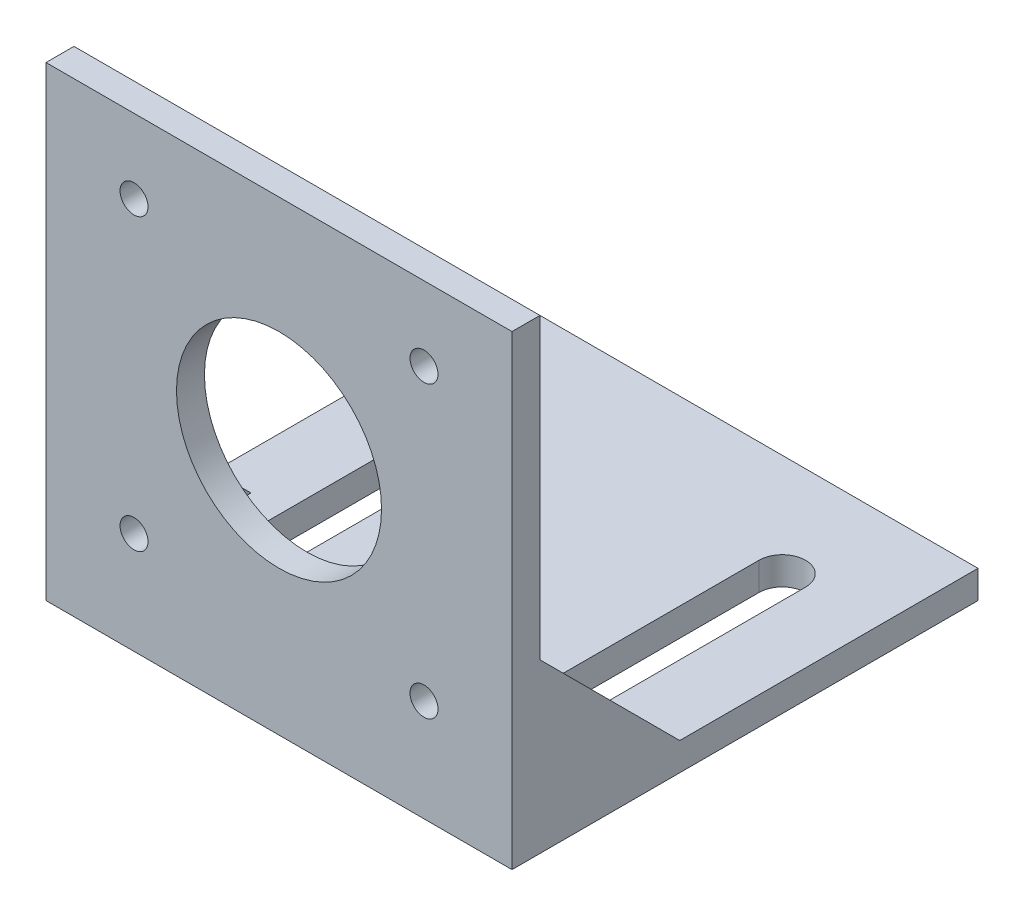
ISO-10303-21;
HEADER;
FILE_DESCRIPTION(('STEP AP214'),'2;1');
FILE_NAME('part.step','',(''),(''),'','','');
FILE_SCHEMA(('AUTOMOTIVE_DESIGN { 1 0 10303 214 1 1 1 1 }'));
ENDSEC;
DATA;
#1=APPLICATION_CONTEXT('core data for automotive mechanical design processes');
#2=APPLICATION_PROTOCOL_DEFINITION('international standard','automotive_design',2000,#1);
#3=PRODUCT_CONTEXT('',#1,'mechanical');
#4=PRODUCT('Part','Part','',(#3));
#5=PRODUCT_RELATED_PRODUCT_CATEGORY('part','',(#4));
#6=PRODUCT_DEFINITION_FORMATION('','',#4);
#7=PRODUCT_DEFINITION_CONTEXT('part definition',#1,'design');
#8=PRODUCT_DEFINITION('design','',#6,#7);
#9=PRODUCT_DEFINITION_SHAPE('','',#8);
#10=(LENGTH_UNIT() NAMED_UNIT(*) SI_UNIT(.MILLI.,.METRE.));
#11=(NAMED_UNIT(*) PLANE_ANGLE_UNIT() SI_UNIT($,.RADIAN.));
#12=(NAMED_UNIT(*) SI_UNIT($,.STERADIAN.) SOLID_ANGLE_UNIT());
#13=UNCERTAINTY_MEASURE_WITH_UNIT(LENGTH_MEASURE(1.E-05),#10,'distance_accuracy_value','');
#14=(GEOMETRIC_REPRESENTATION_CONTEXT(3) GLOBAL_UNCERTAINTY_ASSIGNED_CONTEXT((#13)) GLOBAL_UNIT_ASSIGNED_CONTEXT((#10,
#11,#12)) REPRESENTATION_CONTEXT('',''));
#15=CARTESIAN_POINT('',(0.,0.,0.));
#16=DIRECTION('',(0.,0.,1.));
#17=DIRECTION('',(1.,0.,0.));
#18=AXIS2_PLACEMENT_3D('',#15,#16,#17);
#19=CARTESIAN_POINT('',(50.,3.,-3.));
#20=DIRECTION('',(0.,-1.,0.));
#21=DIRECTION('',(0.,0.,-1.));
#22=AXIS2_PLACEMENT_3D('',#19,#20,#21);
#23=PLANE('',#22);
#24=DIRECTION('',(0.,0.,-1.));
#25=VECTOR('',#24,1.);
#26=CARTESIAN_POINT('',(42.5,3.,-14.));
#27=LINE('',#26,#25);
#28=CARTESIAN_POINT('',(42.5,3.,-14.));
#29=VERTEX_POINT('',#28);
#30=CARTESIAN_POINT('',(42.5,3.,-39.));
#31=VERTEX_POINT('',#30);
#32=EDGE_CURVE('E241',#29,#31,#27,.T.);
#33=ORIENTED_EDGE('',*,*,#32,.F.);
#34=CARTESIAN_POINT('',(40.,3.,-14.));
#35=DIRECTION('',(0.,1.,0.));
#36=DIRECTION('',(0.,0.,-1.));
#37=AXIS2_PLACEMENT_3D('',#34,#35,#36);
#38=CIRCLE('',#37,2.5);
#39=CARTESIAN_POINT('',(37.5,3.,-14.));
#40=VERTEX_POINT('',#39);
#41=EDGE_CURVE('E244',#40,#29,#38,.T.);
#42=ORIENTED_EDGE('',*,*,#41,.F.);
#43=DIRECTION('',(0.,0.,1.));
#44=VECTOR('',#43,1.);
#45=CARTESIAN_POINT('',(37.5,3.,-14.));
#46=LINE('',#45,#44);
#47=CARTESIAN_POINT('',(37.5,3.,-39.));
#48=VERTEX_POINT('',#47);
#49=EDGE_CURVE('E234',#48,#40,#46,.T.);
#50=ORIENTED_EDGE('',*,*,#49,.F.);
#51=CARTESIAN_POINT('',(40.,3.,-39.));
#52=DIRECTION('',(0.,1.,0.));
#53=DIRECTION('',(0.,0.,-1.));
#54=AXIS2_PLACEMENT_3D('',#51,#52,#53);
#55=CIRCLE('',#54,2.5);
#56=EDGE_CURVE('E238',#31,#48,#55,.T.);
#57=ORIENTED_EDGE('',*,*,#56,.F.);
#58=EDGE_LOOP('',(#33,#42,#50,#57));
#59=FACE_BOUND('',#58,.T.);
#60=DIRECTION('',(0.,0.,-1.));
#61=VECTOR('',#60,1.);
#62=CARTESIAN_POINT('',(12.5,3.,-14.));
#63=LINE('',#62,#61);
#64=CARTESIAN_POINT('',(12.5,3.,-14.));
#65=VERTEX_POINT('',#64);
#66=CARTESIAN_POINT('',(12.5,3.,-39.));
#67=VERTEX_POINT('',#66);
#68=EDGE_CURVE('E272',#65,#67,#63,.T.);
#69=ORIENTED_EDGE('',*,*,#68,.F.);
#70=CARTESIAN_POINT('',(10.,3.,-14.));
#71=DIRECTION('',(0.,1.,0.));
#72=DIRECTION('',(0.,0.,1.));
#73=AXIS2_PLACEMENT_3D('',#70,#71,#72);
#74=CIRCLE('',#73,2.5);
#75=CARTESIAN_POINT('',(7.5,3.,-14.));
#76=VERTEX_POINT('',#75);
#77=EDGE_CURVE('E233',#76,#65,#74,.T.);
#78=ORIENTED_EDGE('',*,*,#77,.F.);
#79=DIRECTION('',(0.,0.,1.));
#80=VECTOR('',#79,1.);
#81=CARTESIAN_POINT('',(7.5,3.,-14.));
#82=LINE('',#81,#80);
#83=CARTESIAN_POINT('',(7.5,3.,-39.));
#84=VERTEX_POINT('',#83);
#85=EDGE_CURVE('E265',#84,#76,#82,.T.);
#86=ORIENTED_EDGE('',*,*,#85,.F.);
#87=CARTESIAN_POINT('',(10.,3.,-39.));
#88=DIRECTION('',(0.,1.,0.));
#89=DIRECTION('',(0.,0.,1.));
#90=AXIS2_PLACEMENT_3D('',#87,#88,#89);
#91=CIRCLE('',#90,2.5);
#92=EDGE_CURVE('E269',#67,#84,#91,.T.);
#93=ORIENTED_EDGE('',*,*,#92,.F.);
#94=EDGE_LOOP('',(#69,#78,#86,#93));
#95=FACE_BOUND('',#94,.T.);
#96=DIRECTION('',(-1.,0.,0.));
#97=VECTOR('',#96,1.);
#98=CARTESIAN_POINT('',(4.,3.,-18.));
#99=LINE('',#98,#97);
#100=CARTESIAN_POINT('',(4.,3.,-18.));
#101=VERTEX_POINT('',#100);
#102=CARTESIAN_POINT('',(0.,3.,-18.));
#103=VERTEX_POINT('',#102);
#104=EDGE_CURVE('E51',#101,#103,#99,.T.);
#105=ORIENTED_EDGE('',*,*,#104,.F.);
#106=DIRECTION('',(0.,0.,-1.));
#107=VECTOR('',#106,1.);
#108=CARTESIAN_POINT('',(4.,3.,-3.));
#109=LINE('',#108,#107);
#110=CARTESIAN_POINT('',(4.,3.,-3.));
#111=VERTEX_POINT('',#110);
#112=EDGE_CURVE('E178',#111,#101,#109,.T.);
#113=ORIENTED_EDGE('',*,*,#112,.F.);
#114=DIRECTION('',(-1.,0.,0.));
#115=VECTOR('',#114,1.);
#116=CARTESIAN_POINT('',(50.,3.,-3.));
#117=LINE('',#116,#115);
#118=CARTESIAN_POINT('',(46.,3.,-3.));
#119=VERTEX_POINT('',#118);
#120=EDGE_CURVE('E173',#119,#111,#117,.T.);
#121=ORIENTED_EDGE('',*,*,#120,.F.);
#122=DIRECTION('',(0.,0.,-1.));
#123=VECTOR('',#122,1.);
#124=CARTESIAN_POINT('',(46.,3.,-3.));
#125=LINE('',#124,#123);
#126=CARTESIAN_POINT('',(46.,3.,-18.));
#127=VERTEX_POINT('',#126);
#128=EDGE_CURVE('E162',#119,#127,#125,.T.);
#129=ORIENTED_EDGE('',*,*,#128,.T.);
#130=DIRECTION('',(1.,0.,0.));
#131=VECTOR('',#130,1.);
#132=CARTESIAN_POINT('',(46.,3.,-18.));
#133=LINE('',#132,#131);
#134=CARTESIAN_POINT('',(50.,3.,-18.));
#135=VERTEX_POINT('',#134);
#136=EDGE_CURVE('E286',#127,#135,#133,.T.);
#137=ORIENTED_EDGE('',*,*,#136,.T.);
#138=DIRECTION('',(0.,0.,1.));
#139=VECTOR('',#138,1.);
#140=CARTESIAN_POINT('',(50.,3.,-3.));
#141=LINE('',#140,#139);
#142=CARTESIAN_POINT('',(50.,3.,-50.));
#143=VERTEX_POINT('',#142);
#144=EDGE_CURVE('E212',#143,#135,#141,.T.);
#145=ORIENTED_EDGE('',*,*,#144,.F.);
#146=DIRECTION('',(-1.,0.,0.));
#147=VECTOR('',#146,1.);
#148=CARTESIAN_POINT('',(50.,3.,-50.));
#149=LINE('',#148,#147);
#150=CARTESIAN_POINT('',(0.,3.,-50.));
#151=VERTEX_POINT('',#150);
#152=EDGE_CURVE('E44',#143,#151,#149,.T.);
#153=ORIENTED_EDGE('',*,*,#152,.T.);
#154=DIRECTION('',(0.,0.,1.));
#155=VECTOR('',#154,1.);
#156=CARTESIAN_POINT('',(0.,3.,-3.));
#157=LINE('',#156,#155);
#158=EDGE_CURVE('E200',#151,#103,#157,.T.);
#159=ORIENTED_EDGE('',*,*,#158,.T.);
#160=EDGE_LOOP('',(#105,#113,#121,#129,#137,#145,#153,#159));
#161=FACE_BOUND('',#160,.T.);
#162=ADVANCED_FACE('F35',(#59,#95,#161),#23,.F.);
#163=CARTESIAN_POINT('',(50.,3.,-3.));
#164=DIRECTION('',(0.,0.,1.));
#165=DIRECTION('',(1.,0.,0.));
#166=AXIS2_PLACEMENT_3D('',#163,#164,#165);
#167=PLANE('',#166);
#168=CARTESIAN_POINT('',(9.44365081389596,42.056349186104,-3.));
#169=DIRECTION('',(0.,0.,-1.));
#170=DIRECTION('',(-1.,0.,0.));
#171=AXIS2_PLACEMENT_3D('',#168,#169,#170);
#172=CIRCLE('',#171,1.5);
#173=CARTESIAN_POINT('',(7.94365081389596,42.056349186104,-3.));
#174=VERTEX_POINT('',#173);
#175=EDGE_CURVE('E316',#174,#174,#172,.T.);
#176=ORIENTED_EDGE('',*,*,#175,.F.);
#177=EDGE_LOOP('',(#176));
#178=FACE_BOUND('',#177,.T.);
#179=CARTESIAN_POINT('',(40.556349186104,10.943650813896,-3.));
#180=DIRECTION('',(0.,0.,-1.));
#181=DIRECTION('',(-1.,0.,0.));
#182=AXIS2_PLACEMENT_3D('',#179,#180,#181);
#183=CIRCLE('',#182,1.5);
#184=CARTESIAN_POINT('',(39.056349186104,10.943650813896,-3.));
#185=VERTEX_POINT('',#184);
#186=EDGE_CURVE('E309',#185,#185,#183,.T.);
#187=ORIENTED_EDGE('',*,*,#186,.F.);
#188=EDGE_LOOP('',(#187));
#189=FACE_BOUND('',#188,.T.);
#190=CARTESIAN_POINT('',(9.44365081389596,10.943650813896,-3.));
#191=DIRECTION('',(0.,0.,-1.));
#192=DIRECTION('',(-1.,0.,0.));
#193=AXIS2_PLACEMENT_3D('',#190,#191,#192);
#194=CIRCLE('',#193,1.5);
#195=CARTESIAN_POINT('',(7.94365081389596,10.943650813896,-3.));
#196=VERTEX_POINT('',#195);
#197=EDGE_CURVE('E321',#196,#196,#194,.T.);
#198=ORIENTED_EDGE('',*,*,#197,.F.);
#199=EDGE_LOOP('',(#198));
#200=FACE_BOUND('',#199,.T.);
#201=CARTESIAN_POINT('',(40.556349186104,42.056349186104,-3.));
#202=DIRECTION('',(0.,0.,-1.));
#203=DIRECTION('',(-1.,0.,0.));
#204=AXIS2_PLACEMENT_3D('',#201,#202,#203);
#205=CIRCLE('',#204,1.5);
#206=CARTESIAN_POINT('',(39.056349186104,42.056349186104,-3.));
#207=VERTEX_POINT('',#206);
#208=EDGE_CURVE('E303',#207,#207,#205,.T.);
#209=ORIENTED_EDGE('',*,*,#208,.F.);
#210=EDGE_LOOP('',(#209));
#211=FACE_BOUND('',#210,.T.);
#212=CARTESIAN_POINT('',(25.,26.5,-3.));
#213=DIRECTION('',(0.,0.,-1.));
#214=DIRECTION('',(-1.,0.,0.));
#215=AXIS2_PLACEMENT_3D('',#212,#213,#214);
#216=CIRCLE('',#215,11.);
#217=CARTESIAN_POINT('',(14.,26.5,-3.));
#218=VERTEX_POINT('',#217);
#219=EDGE_CURVE('E219',#218,#218,#216,.T.);
#220=ORIENTED_EDGE('',*,*,#219,.F.);
#221=EDGE_LOOP('',(#220));
#222=FACE_BOUND('',#221,.T.);
#223=DIRECTION('',(-1.,0.,0.));
#224=VECTOR('',#223,1.);
#225=CARTESIAN_POINT('',(4.,18.,-3.));
#226=LINE('',#225,#224);
#227=CARTESIAN_POINT('',(4.,18.,-3.));
#228=VERTEX_POINT('',#227);
#229=CARTESIAN_POINT('',(0.,18.,-3.));
#230=VERTEX_POINT('',#229);
#231=EDGE_CURVE('E292',#228,#230,#226,.T.);
#232=ORIENTED_EDGE('',*,*,#231,.T.);
#233=DIRECTION('',(0.,1.,0.));
#234=VECTOR('',#233,1.);
#235=CARTESIAN_POINT('',(0.,3.,-3.));
#236=LINE('',#235,#234);
#237=CARTESIAN_POINT('',(0.,50.,-3.));
#238=VERTEX_POINT('',#237);
#239=EDGE_CURVE('E198',#230,#238,#236,.T.);
#240=ORIENTED_EDGE('',*,*,#239,.T.);
#241=DIRECTION('',(-1.,0.,0.));
#242=VECTOR('',#241,1.);
#243=CARTESIAN_POINT('',(50.,50.,-3.));
#244=LINE('',#243,#242);
#245=CARTESIAN_POINT('',(50.,50.,-3.));
#246=VERTEX_POINT('',#245);
#247=EDGE_CURVE('E179',#246,#238,#244,.T.);
#248=ORIENTED_EDGE('',*,*,#247,.F.);
#249=DIRECTION('',(0.,1.,0.));
#250=VECTOR('',#249,1.);
#251=CARTESIAN_POINT('',(50.,3.,-3.));
#252=LINE('',#251,#250);
#253=CARTESIAN_POINT('',(50.,18.,-3.));
#254=VERTEX_POINT('',#253);
#255=EDGE_CURVE('E210',#254,#246,#252,.T.);
#256=ORIENTED_EDGE('',*,*,#255,.F.);
#257=DIRECTION('',(1.,0.,0.));
#258=VECTOR('',#257,1.);
#259=CARTESIAN_POINT('',(46.,18.,-3.));
#260=LINE('',#259,#258);
#261=CARTESIAN_POINT('',(46.,18.,-3.));
#262=VERTEX_POINT('',#261);
#263=EDGE_CURVE('E175',#262,#254,#260,.T.);
#264=ORIENTED_EDGE('',*,*,#263,.F.);
#265=DIRECTION('',(0.,-1.,0.));
#266=VECTOR('',#265,1.);
#267=CARTESIAN_POINT('',(46.,18.,-3.));
#268=LINE('',#267,#266);
#269=EDGE_CURVE('E165',#262,#119,#268,.T.);
#270=ORIENTED_EDGE('',*,*,#269,.T.);
#271=ORIENTED_EDGE('',*,*,#120,.T.);
#272=DIRECTION('',(0.,-1.,0.));
#273=VECTOR('',#272,1.);
#274=CARTESIAN_POINT('',(4.,18.,-3.));
#275=LINE('',#274,#273);
#276=EDGE_CURVE('E59',#228,#111,#275,.T.);
#277=ORIENTED_EDGE('',*,*,#276,.F.);
#278=EDGE_LOOP('',(#232,#240,#248,#256,#264,#270,#271,#277));
#279=FACE_BOUND('',#278,.T.);
#280=ADVANCED_FACE('F172',(#178,#189,#200,#211,#222,#279),#167,.F.);
#281=CARTESIAN_POINT('',(50.,0.,0.));
#282=DIRECTION('',(0.,1.,0.));
#283=DIRECTION('',(0.,0.,1.));
#284=AXIS2_PLACEMENT_3D('',#281,#282,#283);
#285=PLANE('',#284);
#286=DIRECTION('',(0.,0.,1.));
#287=VECTOR('',#286,1.);
#288=CARTESIAN_POINT('',(7.5,0.,-14.));
#289=LINE('',#288,#287);
#290=CARTESIAN_POINT('',(7.5,0.,-39.));
#291=VERTEX_POINT('',#290);
#292=CARTESIAN_POINT('',(7.5,0.,-14.));
#293=VERTEX_POINT('',#292);
#294=EDGE_CURVE('E260',#291,#293,#289,.T.);
#295=ORIENTED_EDGE('',*,*,#294,.T.);
#296=CARTESIAN_POINT('',(10.,0.,-14.));
#297=DIRECTION('',(0.,1.,0.));
#298=DIRECTION('',(0.,0.,1.));
#299=AXIS2_PLACEMENT_3D('',#296,#297,#298);
#300=CIRCLE('',#299,2.5);
#301=CARTESIAN_POINT('',(12.5,0.,-14.));
#302=VERTEX_POINT('',#301);
#303=EDGE_CURVE('E268',#293,#302,#300,.T.);
#304=ORIENTED_EDGE('',*,*,#303,.T.);
#305=DIRECTION('',(0.,0.,-1.));
#306=VECTOR('',#305,1.);
#307=CARTESIAN_POINT('',(12.5,0.,-14.));
#308=LINE('',#307,#306);
#309=CARTESIAN_POINT('',(12.5,0.,-39.));
#310=VERTEX_POINT('',#309);
#311=EDGE_CURVE('E281',#302,#310,#308,.T.);
#312=ORIENTED_EDGE('',*,*,#311,.T.);
#313=CARTESIAN_POINT('',(10.,0.,-39.));
#314=DIRECTION('',(0.,1.,0.));
#315=DIRECTION('',(0.,0.,1.));
#316=AXIS2_PLACEMENT_3D('',#313,#314,#315);
#317=CIRCLE('',#316,2.5);
#318=EDGE_CURVE('E278',#310,#291,#317,.T.);
#319=ORIENTED_EDGE('',*,*,#318,.T.);
#320=EDGE_LOOP('',(#295,#304,#312,#319));
#321=FACE_BOUND('',#320,.T.);
#322=DIRECTION('',(0.,0.,1.));
#323=VECTOR('',#322,1.);
#324=CARTESIAN_POINT('',(37.5,0.,-14.));
#325=LINE('',#324,#323);
#326=CARTESIAN_POINT('',(37.5,0.,-39.));
#327=VERTEX_POINT('',#326);
#328=CARTESIAN_POINT('',(37.5,0.,-14.));
#329=VERTEX_POINT('',#328);
#330=EDGE_CURVE('E227',#327,#329,#325,.T.);
#331=ORIENTED_EDGE('',*,*,#330,.T.);
#332=CARTESIAN_POINT('',(40.,0.,-14.));
#333=DIRECTION('',(0.,1.,0.));
#334=DIRECTION('',(0.,0.,-1.));
#335=AXIS2_PLACEMENT_3D('',#332,#333,#334);
#336=CIRCLE('',#335,2.5);
#337=CARTESIAN_POINT('',(42.5,0.,-14.));
#338=VERTEX_POINT('',#337);
#339=EDGE_CURVE('E237',#329,#338,#336,.T.);
#340=ORIENTED_EDGE('',*,*,#339,.T.);
#341=DIRECTION('',(0.,0.,-1.));
#342=VECTOR('',#341,1.);
#343=CARTESIAN_POINT('',(42.5,0.,-14.));
#344=LINE('',#343,#342);
#345=CARTESIAN_POINT('',(42.5,0.,-39.));
#346=VERTEX_POINT('',#345);
#347=EDGE_CURVE('E251',#338,#346,#344,.T.);
#348=ORIENTED_EDGE('',*,*,#347,.T.);
#349=CARTESIAN_POINT('',(40.,0.,-39.));
#350=DIRECTION('',(0.,1.,0.));
#351=DIRECTION('',(0.,0.,-1.));
#352=AXIS2_PLACEMENT_3D('',#349,#350,#351);
#353=CIRCLE('',#352,2.5);
#354=EDGE_CURVE('E248',#346,#327,#353,.T.);
#355=ORIENTED_EDGE('',*,*,#354,.T.);
#356=EDGE_LOOP('',(#331,#340,#348,#355));
#357=FACE_BOUND('',#356,.T.);
#358=DIRECTION('',(0.,0.,-1.));
#359=VECTOR('',#358,1.);
#360=CARTESIAN_POINT('',(0.,0.,0.));
#361=LINE('',#360,#359);
#362=CARTESIAN_POINT('',(0.,0.,0.));
#363=VERTEX_POINT('',#362);
#364=CARTESIAN_POINT('',(0.,0.,-50.));
#365=VERTEX_POINT('',#364);
#366=EDGE_CURVE('E204',#363,#365,#361,.T.);
#367=ORIENTED_EDGE('',*,*,#366,.T.);
#368=DIRECTION('',(-1.,0.,0.));
#369=VECTOR('',#368,1.);
#370=CARTESIAN_POINT('',(50.,0.,-50.));
#371=LINE('',#370,#369);
#372=CARTESIAN_POINT('',(50.,0.,-50.));
#373=VERTEX_POINT('',#372);
#374=EDGE_CURVE('E11',#373,#365,#371,.T.);
#375=ORIENTED_EDGE('',*,*,#374,.F.);
#376=DIRECTION('',(0.,0.,-1.));
#377=VECTOR('',#376,1.);
#378=CARTESIAN_POINT('',(50.,0.,0.));
#379=LINE('',#378,#377);
#380=CARTESIAN_POINT('',(50.,0.,0.));
#381=VERTEX_POINT('',#380);
#382=EDGE_CURVE('E195',#381,#373,#379,.T.);
#383=ORIENTED_EDGE('',*,*,#382,.F.);
#384=DIRECTION('',(-1.,0.,0.));
#385=VECTOR('',#384,1.);
#386=CARTESIAN_POINT('',(50.,0.,0.));
#387=LINE('',#386,#385);
#388=EDGE_CURVE('E189',#381,#363,#387,.T.);
#389=ORIENTED_EDGE('',*,*,#388,.T.);
#390=EDGE_LOOP('',(#367,#375,#383,#389));
#391=FACE_BOUND('',#390,.T.);
#392=ADVANCED_FACE('F37',(#321,#357,#391),#285,.F.);
#393=CARTESIAN_POINT('',(50.,0.,-50.));
#394=DIRECTION('',(0.,0.,1.));
#395=DIRECTION('',(1.,0.,0.));
#396=AXIS2_PLACEMENT_3D('',#393,#394,#395);
#397=PLANE('',#396);
#398=DIRECTION('',(0.,1.,0.));
#399=VECTOR('',#398,1.);
#400=CARTESIAN_POINT('',(0.,0.,-50.));
#401=LINE('',#400,#399);
#402=EDGE_CURVE('E202',#365,#151,#401,.T.);
#403=ORIENTED_EDGE('',*,*,#402,.T.);
#404=ORIENTED_EDGE('',*,*,#152,.F.);
#405=DIRECTION('',(0.,1.,0.));
#406=VECTOR('',#405,1.);
#407=CARTESIAN_POINT('',(50.,0.,-50.));
#408=LINE('',#407,#406);
#409=EDGE_CURVE('E215',#373,#143,#408,.T.);
#410=ORIENTED_EDGE('',*,*,#409,.F.);
#411=ORIENTED_EDGE('',*,*,#374,.T.);
#412=EDGE_LOOP('',(#403,#404,#410,#411));
#413=FACE_BOUND('',#412,.T.);
#414=ADVANCED_FACE('F376',(#413),#397,.F.);
#415=CARTESIAN_POINT('',(50.,50.,0.));
#416=DIRECTION('',(0.,-1.,0.));
#417=DIRECTION('',(0.,0.,-1.));
#418=AXIS2_PLACEMENT_3D('',#415,#416,#417);
#419=PLANE('',#418);
#420=DIRECTION('',(0.,0.,1.));
#421=VECTOR('',#420,1.);
#422=CARTESIAN_POINT('',(0.,50.,0.));
#423=LINE('',#422,#421);
#424=CARTESIAN_POINT('',(0.,50.,0.));
#425=VERTEX_POINT('',#424);
#426=EDGE_CURVE('E196',#238,#425,#423,.T.);
#427=ORIENTED_EDGE('',*,*,#426,.T.);
#428=DIRECTION('',(-1.,0.,0.));
#429=VECTOR('',#428,1.);
#430=CARTESIAN_POINT('',(50.,50.,0.));
#431=LINE('',#430,#429);
#432=CARTESIAN_POINT('',(50.,50.,0.));
#433=VERTEX_POINT('',#432);
#434=EDGE_CURVE('E184',#433,#425,#431,.T.);
#435=ORIENTED_EDGE('',*,*,#434,.F.);
#436=DIRECTION('',(0.,0.,1.));
#437=VECTOR('',#436,1.);
#438=CARTESIAN_POINT('',(50.,50.,0.));
#439=LINE('',#438,#437);
#440=EDGE_CURVE('E208',#246,#433,#439,.T.);
#441=ORIENTED_EDGE('',*,*,#440,.F.);
#442=ORIENTED_EDGE('',*,*,#247,.T.);
#443=EDGE_LOOP('',(#427,#435,#441,#442));
#444=FACE_BOUND('',#443,.T.);
#445=ADVANCED_FACE('F358',(#444),#419,.F.);
#446=CARTESIAN_POINT('',(50.,0.,0.));
#447=DIRECTION('',(0.,0.,-1.));
#448=DIRECTION('',(-1.,0.,0.));
#449=AXIS2_PLACEMENT_3D('',#446,#447,#448);
#450=PLANE('',#449);
#451=CARTESIAN_POINT('',(9.44365081389596,42.056349186104,0.));
#452=DIRECTION('',(0.,0.,-1.));
#453=DIRECTION('',(-1.,0.,0.));
#454=AXIS2_PLACEMENT_3D('',#451,#452,#453);
#455=CIRCLE('',#454,1.5);
#456=CARTESIAN_POINT('',(7.94365081389596,42.056349186104,0.));
#457=VERTEX_POINT('',#456);
#458=EDGE_CURVE('E306',#457,#457,#455,.T.);
#459=ORIENTED_EDGE('',*,*,#458,.T.);
#460=EDGE_LOOP('',(#459));
#461=FACE_BOUND('',#460,.T.);
#462=CARTESIAN_POINT('',(40.556349186104,10.943650813896,0.));
#463=DIRECTION('',(0.,0.,-1.));
#464=DIRECTION('',(-1.,0.,0.));
#465=AXIS2_PLACEMENT_3D('',#462,#463,#464);
#466=CIRCLE('',#465,1.5);
#467=CARTESIAN_POINT('',(39.056349186104,10.943650813896,0.));
#468=VERTEX_POINT('',#467);
#469=EDGE_CURVE('E312',#468,#468,#466,.T.);
#470=ORIENTED_EDGE('',*,*,#469,.T.);
#471=EDGE_LOOP('',(#470));
#472=FACE_BOUND('',#471,.T.);
#473=CARTESIAN_POINT('',(9.44365081389596,10.943650813896,0.));
#474=DIRECTION('',(0.,0.,-1.));
#475=DIRECTION('',(-1.,0.,0.));
#476=AXIS2_PLACEMENT_3D('',#473,#474,#475);
#477=CIRCLE('',#476,1.5);
#478=CARTESIAN_POINT('',(7.94365081389596,10.943650813896,0.));
#479=VERTEX_POINT('',#478);
#480=EDGE_CURVE('E313',#479,#479,#477,.T.);
#481=ORIENTED_EDGE('',*,*,#480,.T.);
#482=EDGE_LOOP('',(#481));
#483=FACE_BOUND('',#482,.T.);
#484=CARTESIAN_POINT('',(40.556349186104,42.056349186104,0.));
#485=DIRECTION('',(0.,0.,-1.));
#486=DIRECTION('',(-1.,0.,0.));
#487=AXIS2_PLACEMENT_3D('',#484,#485,#486);
#488=CIRCLE('',#487,1.5);
#489=CARTESIAN_POINT('',(39.056349186104,42.056349186104,0.));
#490=VERTEX_POINT('',#489);
#491=EDGE_CURVE('E298',#490,#490,#488,.T.);
#492=ORIENTED_EDGE('',*,*,#491,.T.);
#493=EDGE_LOOP('',(#492));
#494=FACE_BOUND('',#493,.T.);
#495=CARTESIAN_POINT('',(25.,26.5,0.));
#496=DIRECTION('',(0.,0.,-1.));
#497=DIRECTION('',(-1.,0.,0.));
#498=AXIS2_PLACEMENT_3D('',#495,#496,#497);
#499=CIRCLE('',#498,11.);
#500=CARTESIAN_POINT('',(14.,26.5,0.));
#501=VERTEX_POINT('',#500);
#502=EDGE_CURVE('E39',#501,#501,#499,.T.);
#503=ORIENTED_EDGE('',*,*,#502,.T.);
#504=EDGE_LOOP('',(#503));
#505=FACE_BOUND('',#504,.T.);
#506=DIRECTION('',(0.,-1.,0.));
#507=VECTOR('',#506,1.);
#508=CARTESIAN_POINT('',(0.,0.,0.));
#509=LINE('',#508,#507);
#510=EDGE_CURVE('E193',#425,#363,#509,.T.);
#511=ORIENTED_EDGE('',*,*,#510,.T.);
#512=ORIENTED_EDGE('',*,*,#388,.F.);
#513=DIRECTION('',(0.,-1.,0.));
#514=VECTOR('',#513,1.);
#515=CARTESIAN_POINT('',(50.,0.,0.));
#516=LINE('',#515,#514);
#517=EDGE_CURVE('E192',#433,#381,#516,.T.);
#518=ORIENTED_EDGE('',*,*,#517,.F.);
#519=ORIENTED_EDGE('',*,*,#434,.T.);
#520=EDGE_LOOP('',(#511,#512,#518,#519));
#521=FACE_BOUND('',#520,.T.);
#522=ADVANCED_FACE('F327',(#461,#472,#483,#494,#505,#521),#450,.F.);
#523=CARTESIAN_POINT('',(50.,0.,0.));
#524=DIRECTION('',(1.,0.,0.));
#525=DIRECTION('',(0.,0.,-1.));
#526=AXIS2_PLACEMENT_3D('',#523,#524,#525);
#527=PLANE('',#526);
#528=DIRECTION('',(0.,0.707106781186547,0.707106781186548));
#529=VECTOR('',#528,1.);
#530=CARTESIAN_POINT('',(50.,3.,-18.));
#531=LINE('',#530,#529);
#532=EDGE_CURVE('E176',#135,#254,#531,.T.);
#533=ORIENTED_EDGE('',*,*,#532,.T.);
#534=ORIENTED_EDGE('',*,*,#255,.T.);
#535=ORIENTED_EDGE('',*,*,#440,.T.);
#536=ORIENTED_EDGE('',*,*,#517,.T.);
#537=ORIENTED_EDGE('',*,*,#382,.T.);
#538=ORIENTED_EDGE('',*,*,#409,.T.);
#539=ORIENTED_EDGE('',*,*,#144,.T.);
#540=EDGE_LOOP('',(#533,#534,#535,#536,#537,#538,#539));
#541=FACE_BOUND('',#540,.T.);
#542=ADVANCED_FACE('F357',(#541),#527,.T.);
#543=CARTESIAN_POINT('',(0.,0.,0.));
#544=DIRECTION('',(1.,0.,0.));
#545=DIRECTION('',(0.,0.,-1.));
#546=AXIS2_PLACEMENT_3D('',#543,#544,#545);
#547=PLANE('',#546);
#548=ORIENTED_EDGE('',*,*,#239,.F.);
#549=DIRECTION('',(0.,0.707106781186547,0.707106781186548));
#550=VECTOR('',#549,1.);
#551=CARTESIAN_POINT('',(0.,3.,-18.));
#552=LINE('',#551,#550);
#553=EDGE_CURVE('E295',#103,#230,#552,.T.);
#554=ORIENTED_EDGE('',*,*,#553,.F.);
#555=ORIENTED_EDGE('',*,*,#158,.F.);
#556=ORIENTED_EDGE('',*,*,#402,.F.);
#557=ORIENTED_EDGE('',*,*,#366,.F.);
#558=ORIENTED_EDGE('',*,*,#510,.F.);
#559=ORIENTED_EDGE('',*,*,#426,.F.);
#560=EDGE_LOOP('',(#548,#554,#555,#556,#557,#558,#559));
#561=FACE_BOUND('',#560,.T.);
#562=ADVANCED_FACE('F350',(#561),#547,.F.);
#563=CARTESIAN_POINT('',(25.,26.5,17.));
#564=DIRECTION('',(0.,0.,-1.));
#565=DIRECTION('',(-1.,0.,0.));
#566=AXIS2_PLACEMENT_3D('',#563,#564,#565);
#567=CYLINDRICAL_SURFACE('',#566,11.);
#568=ORIENTED_EDGE('',*,*,#219,.T.);
#569=EDGE_LOOP('',(#568));
#570=FACE_BOUND('',#569,.T.);
#571=ORIENTED_EDGE('',*,*,#502,.F.);
#572=EDGE_LOOP('',(#571));
#573=FACE_BOUND('',#572,.T.);
#574=ADVANCED_FACE('F346',(#570,#573),#567,.F.);
#575=CARTESIAN_POINT('',(40.,0.,-14.));
#576=DIRECTION('',(0.,1.,0.));
#577=DIRECTION('',(0.,0.,1.));
#578=AXIS2_PLACEMENT_3D('',#575,#576,#577);
#579=CYLINDRICAL_SURFACE('',#578,2.5);
#580=ORIENTED_EDGE('',*,*,#41,.T.);
#581=DIRECTION('',(0.,1.,0.));
#582=VECTOR('',#581,1.);
#583=CARTESIAN_POINT('',(42.5,0.,-14.));
#584=LINE('',#583,#582);
#585=EDGE_CURVE('E223',#338,#29,#584,.T.);
#586=ORIENTED_EDGE('',*,*,#585,.F.);
#587=ORIENTED_EDGE('',*,*,#339,.F.);
#588=DIRECTION('',(0.,1.,0.));
#589=VECTOR('',#588,1.);
#590=CARTESIAN_POINT('',(37.5,0.,-14.));
#591=LINE('',#590,#589);
#592=EDGE_CURVE('E231',#329,#40,#591,.T.);
#593=ORIENTED_EDGE('',*,*,#592,.T.);
#594=EDGE_LOOP('',(#580,#586,#587,#593));
#595=FACE_BOUND('',#594,.T.);
#596=ADVANCED_FACE('F349',(#595),#579,.F.);
#597=CARTESIAN_POINT('',(37.5,0.,-14.));
#598=DIRECTION('',(-1.,0.,0.));
#599=DIRECTION('',(0.,0.,1.));
#600=AXIS2_PLACEMENT_3D('',#597,#598,#599);
#601=PLANE('',#600);
#602=ORIENTED_EDGE('',*,*,#49,.T.);
#603=ORIENTED_EDGE('',*,*,#592,.F.);
#604=ORIENTED_EDGE('',*,*,#330,.F.);
#605=DIRECTION('',(0.,1.,0.));
#606=VECTOR('',#605,1.);
#607=CARTESIAN_POINT('',(37.5,0.,-39.));
#608=LINE('',#607,#606);
#609=EDGE_CURVE('E229',#327,#48,#608,.T.);
#610=ORIENTED_EDGE('',*,*,#609,.T.);
#611=EDGE_LOOP('',(#602,#603,#604,#610));
#612=FACE_BOUND('',#611,.T.);
#613=ADVANCED_FACE('F422',(#612),#601,.F.);
#614=CARTESIAN_POINT('',(40.,0.,-39.));
#615=DIRECTION('',(0.,1.,0.));
#616=DIRECTION('',(0.,0.,1.));
#617=AXIS2_PLACEMENT_3D('',#614,#615,#616);
#618=CYLINDRICAL_SURFACE('',#617,2.5);
#619=ORIENTED_EDGE('',*,*,#56,.T.);
#620=ORIENTED_EDGE('',*,*,#609,.F.);
#621=ORIENTED_EDGE('',*,*,#354,.F.);
#622=DIRECTION('',(0.,1.,0.));
#623=VECTOR('',#622,1.);
#624=CARTESIAN_POINT('',(42.5,0.,-39.));
#625=LINE('',#624,#623);
#626=EDGE_CURVE('E226',#346,#31,#625,.T.);
#627=ORIENTED_EDGE('',*,*,#626,.T.);
#628=EDGE_LOOP('',(#619,#620,#621,#627));
#629=FACE_BOUND('',#628,.T.);
#630=ADVANCED_FACE('F432',(#629),#618,.F.);
#631=CARTESIAN_POINT('',(42.5,0.,-14.));
#632=DIRECTION('',(1.,0.,0.));
#633=DIRECTION('',(0.,0.,-1.));
#634=AXIS2_PLACEMENT_3D('',#631,#632,#633);
#635=PLANE('',#634);
#636=ORIENTED_EDGE('',*,*,#32,.T.);
#637=ORIENTED_EDGE('',*,*,#626,.F.);
#638=ORIENTED_EDGE('',*,*,#347,.F.);
#639=ORIENTED_EDGE('',*,*,#585,.T.);
#640=EDGE_LOOP('',(#636,#637,#638,#639));
#641=FACE_BOUND('',#640,.T.);
#642=ADVANCED_FACE('F429',(#641),#635,.F.);
#643=CARTESIAN_POINT('',(10.,0.,-14.));
#644=DIRECTION('',(0.,1.,0.));
#645=DIRECTION('',(0.,0.,1.));
#646=AXIS2_PLACEMENT_3D('',#643,#644,#645);
#647=CYLINDRICAL_SURFACE('',#646,2.5);
#648=ORIENTED_EDGE('',*,*,#77,.T.);
#649=DIRECTION('',(0.,1.,0.));
#650=VECTOR('',#649,1.);
#651=CARTESIAN_POINT('',(12.5,0.,-14.));
#652=LINE('',#651,#650);
#653=EDGE_CURVE('E256',#302,#65,#652,.T.);
#654=ORIENTED_EDGE('',*,*,#653,.F.);
#655=ORIENTED_EDGE('',*,*,#303,.F.);
#656=DIRECTION('',(0.,1.,0.));
#657=VECTOR('',#656,1.);
#658=CARTESIAN_POINT('',(7.5,0.,-14.));
#659=LINE('',#658,#657);
#660=EDGE_CURVE('E222',#293,#76,#659,.T.);
#661=ORIENTED_EDGE('',*,*,#660,.T.);
#662=EDGE_LOOP('',(#648,#654,#655,#661));
#663=FACE_BOUND('',#662,.T.);
#664=ADVANCED_FACE('F439',(#663),#647,.F.);
#665=CARTESIAN_POINT('',(7.5,0.,-14.));
#666=DIRECTION('',(-1.,0.,0.));
#667=DIRECTION('',(0.,0.,1.));
#668=AXIS2_PLACEMENT_3D('',#665,#666,#667);
#669=PLANE('',#668);
#670=ORIENTED_EDGE('',*,*,#85,.T.);
#671=ORIENTED_EDGE('',*,*,#660,.F.);
#672=ORIENTED_EDGE('',*,*,#294,.F.);
#673=DIRECTION('',(0.,1.,0.));
#674=VECTOR('',#673,1.);
#675=CARTESIAN_POINT('',(7.5,0.,-39.));
#676=LINE('',#675,#674);
#677=EDGE_CURVE('E262',#291,#84,#676,.T.);
#678=ORIENTED_EDGE('',*,*,#677,.T.);
#679=EDGE_LOOP('',(#670,#671,#672,#678));
#680=FACE_BOUND('',#679,.T.);
#681=ADVANCED_FACE('F484',(#680),#669,.F.);
#682=CARTESIAN_POINT('',(10.,0.,-39.));
#683=DIRECTION('',(0.,1.,0.));
#684=DIRECTION('',(0.,0.,1.));
#685=AXIS2_PLACEMENT_3D('',#682,#683,#684);
#686=CYLINDRICAL_SURFACE('',#685,2.5);
#687=ORIENTED_EDGE('',*,*,#92,.T.);
#688=ORIENTED_EDGE('',*,*,#677,.F.);
#689=ORIENTED_EDGE('',*,*,#318,.F.);
#690=DIRECTION('',(0.,1.,0.));
#691=VECTOR('',#690,1.);
#692=CARTESIAN_POINT('',(12.5,0.,-39.));
#693=LINE('',#692,#691);
#694=EDGE_CURVE('E259',#310,#67,#693,.T.);
#695=ORIENTED_EDGE('',*,*,#694,.T.);
#696=EDGE_LOOP('',(#687,#688,#689,#695));
#697=FACE_BOUND('',#696,.T.);
#698=ADVANCED_FACE('F493',(#697),#686,.F.);
#699=CARTESIAN_POINT('',(12.5,0.,-14.));
#700=DIRECTION('',(1.,0.,0.));
#701=DIRECTION('',(0.,0.,-1.));
#702=AXIS2_PLACEMENT_3D('',#699,#700,#701);
#703=PLANE('',#702);
#704=ORIENTED_EDGE('',*,*,#68,.T.);
#705=ORIENTED_EDGE('',*,*,#694,.F.);
#706=ORIENTED_EDGE('',*,*,#311,.F.);
#707=ORIENTED_EDGE('',*,*,#653,.T.);
#708=EDGE_LOOP('',(#704,#705,#706,#707));
#709=FACE_BOUND('',#708,.T.);
#710=ADVANCED_FACE('F503',(#709),#703,.F.);
#711=CARTESIAN_POINT('',(46.,3.,-18.));
#712=DIRECTION('',(0.,0.707106781186548,-0.707106781186547));
#713=DIRECTION('',(0.,0.707106781186547,0.707106781186548));
#714=AXIS2_PLACEMENT_3D('',#711,#712,#713);
#715=PLANE('',#714);
#716=ORIENTED_EDGE('',*,*,#532,.F.);
#717=ORIENTED_EDGE('',*,*,#136,.F.);
#718=DIRECTION('',(0.,0.707106781186547,0.707106781186548));
#719=VECTOR('',#718,1.);
#720=CARTESIAN_POINT('',(46.,3.,-18.));
#721=LINE('',#720,#719);
#722=EDGE_CURVE('E167',#127,#262,#721,.T.);
#723=ORIENTED_EDGE('',*,*,#722,.T.);
#724=ORIENTED_EDGE('',*,*,#263,.T.);
#725=EDGE_LOOP('',(#716,#717,#723,#724));
#726=FACE_BOUND('',#725,.T.);
#727=ADVANCED_FACE('F512',(#726),#715,.T.);
#728=CARTESIAN_POINT('',(46.,0.,0.));
#729=DIRECTION('',(1.,0.,0.));
#730=DIRECTION('',(0.,0.,-1.));
#731=AXIS2_PLACEMENT_3D('',#728,#729,#730);
#732=PLANE('',#731);
#733=ORIENTED_EDGE('',*,*,#269,.F.);
#734=ORIENTED_EDGE('',*,*,#722,.F.);
#735=ORIENTED_EDGE('',*,*,#128,.F.);
#736=EDGE_LOOP('',(#733,#734,#735));
#737=FACE_BOUND('',#736,.T.);
#738=ADVANCED_FACE('F164',(#737),#732,.F.);
#739=CARTESIAN_POINT('',(4.,3.,-18.));
#740=DIRECTION('',(0.,-0.707106781186548,0.707106781186547));
#741=DIRECTION('',(0.,-0.707106781186547,-0.707106781186548));
#742=AXIS2_PLACEMENT_3D('',#739,#740,#741);
#743=PLANE('',#742);
#744=ORIENTED_EDGE('',*,*,#553,.T.);
#745=ORIENTED_EDGE('',*,*,#231,.F.);
#746=DIRECTION('',(0.,0.707106781186547,0.707106781186548));
#747=VECTOR('',#746,1.);
#748=CARTESIAN_POINT('',(4.,3.,-18.));
#749=LINE('',#748,#747);
#750=EDGE_CURVE('E300',#101,#228,#749,.T.);
#751=ORIENTED_EDGE('',*,*,#750,.F.);
#752=ORIENTED_EDGE('',*,*,#104,.T.);
#753=EDGE_LOOP('',(#744,#745,#751,#752));
#754=FACE_BOUND('',#753,.T.);
#755=ADVANCED_FACE('F384',(#754),#743,.F.);
#756=CARTESIAN_POINT('',(4.,0.,0.));
#757=DIRECTION('',(-1.,0.,0.));
#758=DIRECTION('',(0.,0.,-1.));
#759=AXIS2_PLACEMENT_3D('',#756,#757,#758);
#760=PLANE('',#759);
#761=ORIENTED_EDGE('',*,*,#276,.T.);
#762=ORIENTED_EDGE('',*,*,#112,.T.);
#763=ORIENTED_EDGE('',*,*,#750,.T.);
#764=EDGE_LOOP('',(#761,#762,#763));
#765=FACE_BOUND('',#764,.T.);
#766=ADVANCED_FACE('F387',(#765),#760,.F.);
#767=CARTESIAN_POINT('',(40.556349186104,42.056349186104,0.));
#768=DIRECTION('',(0.,0.,-1.));
#769=DIRECTION('',(-1.,0.,0.));
#770=AXIS2_PLACEMENT_3D('',#767,#768,#769);
#771=CYLINDRICAL_SURFACE('',#770,1.5);
#772=ORIENTED_EDGE('',*,*,#491,.F.);
#773=EDGE_LOOP('',(#772));
#774=FACE_BOUND('',#773,.T.);
#775=ORIENTED_EDGE('',*,*,#208,.T.);
#776=EDGE_LOOP('',(#775));
#777=FACE_BOUND('',#776,.T.);
#778=ADVANCED_FACE('F334',(#774,#777),#771,.F.);
#779=CARTESIAN_POINT('',(9.44365081389596,10.943650813896,0.));
#780=DIRECTION('',(0.,0.,-1.));
#781=DIRECTION('',(-1.,0.,0.));
#782=AXIS2_PLACEMENT_3D('',#779,#780,#781);
#783=CYLINDRICAL_SURFACE('',#782,1.5);
#784=ORIENTED_EDGE('',*,*,#480,.F.);
#785=EDGE_LOOP('',(#784));
#786=FACE_BOUND('',#785,.T.);
#787=ORIENTED_EDGE('',*,*,#197,.T.);
#788=EDGE_LOOP('',(#787));
#789=FACE_BOUND('',#788,.T.);
#790=ADVANCED_FACE('F330',(#786,#789),#783,.F.);
#791=CARTESIAN_POINT('',(40.556349186104,10.943650813896,0.));
#792=DIRECTION('',(0.,0.,-1.));
#793=DIRECTION('',(-1.,0.,0.));
#794=AXIS2_PLACEMENT_3D('',#791,#792,#793);
#795=CYLINDRICAL_SURFACE('',#794,1.5);
#796=ORIENTED_EDGE('',*,*,#469,.F.);
#797=EDGE_LOOP('',(#796));
#798=FACE_BOUND('',#797,.T.);
#799=ORIENTED_EDGE('',*,*,#186,.T.);
#800=EDGE_LOOP('',(#799));
#801=FACE_BOUND('',#800,.T.);
#802=ADVANCED_FACE('F333',(#798,#801),#795,.F.);
#803=CARTESIAN_POINT('',(9.44365081389596,42.056349186104,0.));
#804=DIRECTION('',(0.,0.,-1.));
#805=DIRECTION('',(-1.,0.,0.));
#806=AXIS2_PLACEMENT_3D('',#803,#804,#805);
#807=CYLINDRICAL_SURFACE('',#806,1.5);
#808=ORIENTED_EDGE('',*,*,#458,.F.);
#809=EDGE_LOOP('',(#808));
#810=FACE_BOUND('',#809,.T.);
#811=ORIENTED_EDGE('',*,*,#175,.T.);
#812=EDGE_LOOP('',(#811));
#813=FACE_BOUND('',#812,.T.);
#814=ADVANCED_FACE('F574',(#810,#813),#807,.F.);
#815=CLOSED_SHELL('',(#162,#280,#392,#414,#445,#522,#542,#562,#574,#596,#613,#630,#642,#664,
#681,#698,#710,#727,#738,#755,#766,#778,#790,#802,#814));
#816=MANIFOLD_SOLID_BREP('B2',#815);
#817=ADVANCED_BREP_SHAPE_REPRESENTATION('',(#18,#816),#14);
#818=SHAPE_DEFINITION_REPRESENTATION(#9,#817);
ENDSEC;
END-ISO-10303-21;
